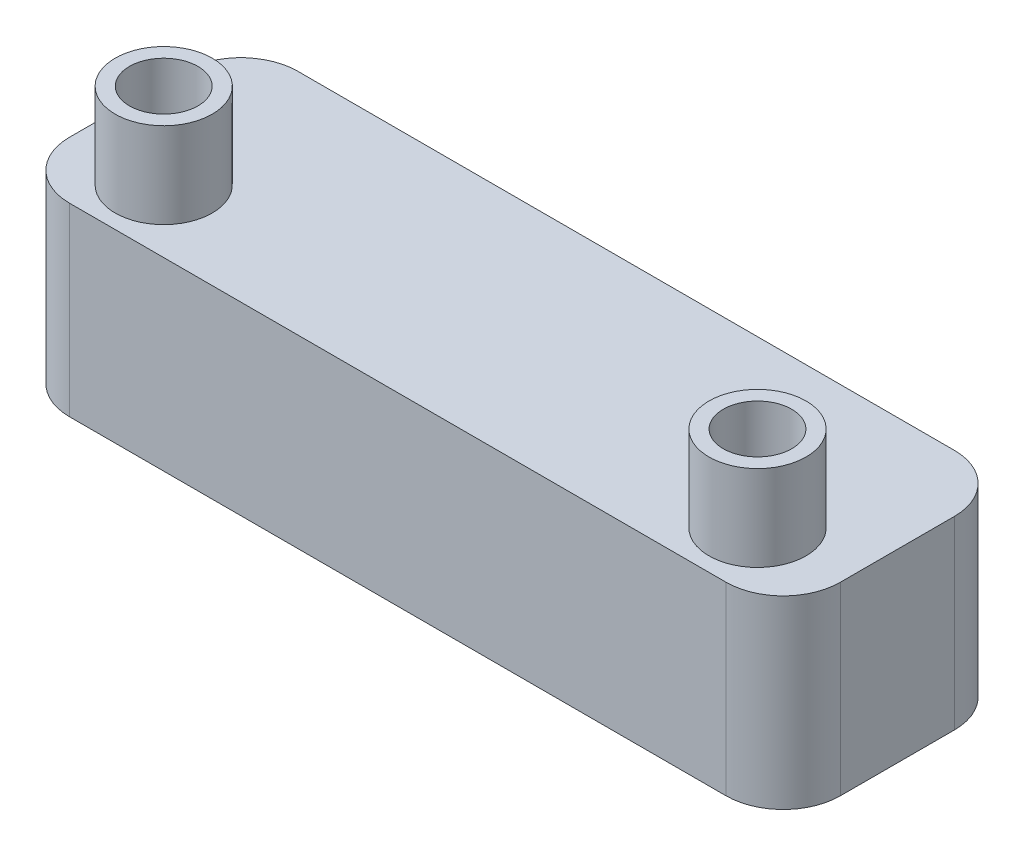
ISO-10303-21;
HEADER;
FILE_DESCRIPTION(('STEP AP214'),'2;1');
FILE_NAME('part.step','',(''),(''),'','','');
FILE_SCHEMA(('AUTOMOTIVE_DESIGN { 1 0 10303 214 1 1 1 1 }'));
ENDSEC;
DATA;
#1=APPLICATION_CONTEXT('core data for automotive mechanical design processes');
#2=APPLICATION_PROTOCOL_DEFINITION('international standard','automotive_design',2000,#1);
#3=PRODUCT_CONTEXT('',#1,'mechanical');
#4=PRODUCT('Part','Part','',(#3));
#5=PRODUCT_RELATED_PRODUCT_CATEGORY('part','',(#4));
#6=PRODUCT_DEFINITION_FORMATION('','',#4);
#7=PRODUCT_DEFINITION_CONTEXT('part definition',#1,'design');
#8=PRODUCT_DEFINITION('design','',#6,#7);
#9=PRODUCT_DEFINITION_SHAPE('','',#8);
#10=(LENGTH_UNIT() NAMED_UNIT(*) SI_UNIT(.MILLI.,.METRE.));
#11=(NAMED_UNIT(*) PLANE_ANGLE_UNIT() SI_UNIT($,.RADIAN.));
#12=(NAMED_UNIT(*) SI_UNIT($,.STERADIAN.) SOLID_ANGLE_UNIT());
#13=UNCERTAINTY_MEASURE_WITH_UNIT(LENGTH_MEASURE(1.E-05),#10,'distance_accuracy_value','');
#14=(GEOMETRIC_REPRESENTATION_CONTEXT(3) GLOBAL_UNCERTAINTY_ASSIGNED_CONTEXT((#13)) GLOBAL_UNIT_ASSIGNED_CONTEXT((#10,
#11,#12)) REPRESENTATION_CONTEXT('',''));
#15=CARTESIAN_POINT('',(0.,0.,0.));
#16=DIRECTION('',(0.,0.,1.));
#17=DIRECTION('',(1.,0.,0.));
#18=AXIS2_PLACEMENT_3D('',#15,#16,#17);
#19=CARTESIAN_POINT('',(-58.072,32.4,2.928));
#20=DIRECTION('',(0.,1.,0.));
#21=DIRECTION('',(0.,0.,1.));
#22=AXIS2_PLACEMENT_3D('',#19,#20,#21);
#23=PLANE('',#22);
#24=CARTESIAN_POINT('',(-52.,32.4,9.));
#25=DIRECTION('',(0.,1.,0.));
#26=DIRECTION('',(0.,0.,1.));
#27=AXIS2_PLACEMENT_3D('',#24,#25,#26);
#28=CIRCLE('',#27,6.);
#29=CARTESIAN_POINT('',(-52.,32.4,15.));
#30=VERTEX_POINT('',#29);
#31=EDGE_CURVE('E21',#30,#30,#28,.F.);
#32=ORIENTED_EDGE('',*,*,#31,.F.);
#33=EDGE_LOOP('',(#32));
#34=FACE_BOUND('',#33,.T.);
#35=ADVANCED_FACE('F17',(#34),#23,.T.);
#36=CARTESIAN_POINT('',(45.928,32.4,2.928));
#37=DIRECTION('',(0.,1.,0.));
#38=DIRECTION('',(0.,0.,1.));
#39=AXIS2_PLACEMENT_3D('',#36,#37,#38);
#40=PLANE('',#39);
#41=CARTESIAN_POINT('',(52.,32.4,9.));
#42=DIRECTION('',(0.,1.,0.));
#43=DIRECTION('',(0.,0.,1.));
#44=AXIS2_PLACEMENT_3D('',#41,#42,#43);
#45=CIRCLE('',#44,6.);
#46=CARTESIAN_POINT('',(52.,32.4,15.));
#47=VERTEX_POINT('',#46);
#48=EDGE_CURVE('E134',#47,#47,#45,.F.);
#49=ORIENTED_EDGE('',*,*,#48,.F.);
#50=EDGE_LOOP('',(#49));
#51=FACE_BOUND('',#50,.T.);
#52=ADVANCED_FACE('F145',(#51),#40,.T.);
#53=CARTESIAN_POINT('',(-52.,32.4,9.));
#54=DIRECTION('',(0.,1.,0.));
#55=DIRECTION('',(0.,0.,1.));
#56=AXIS2_PLACEMENT_3D('',#53,#54,#55);
#57=CYLINDRICAL_SURFACE('',#56,6.);
#58=ORIENTED_EDGE('',*,*,#31,.T.);
#59=EDGE_LOOP('',(#58));
#60=FACE_BOUND('',#59,.T.);
#61=CARTESIAN_POINT('',(-52.,47.4,9.));
#62=DIRECTION('',(0.,1.,0.));
#63=DIRECTION('',(0.,0.,1.));
#64=AXIS2_PLACEMENT_3D('',#61,#62,#63);
#65=CIRCLE('',#64,6.);
#66=CARTESIAN_POINT('',(-52.,47.4,15.));
#67=VERTEX_POINT('',#66);
#68=EDGE_CURVE('E132',#67,#67,#65,.F.);
#69=ORIENTED_EDGE('',*,*,#68,.F.);
#70=EDGE_LOOP('',(#69));
#71=FACE_BOUND('',#70,.T.);
#72=ADVANCED_FACE('F141',(#60,#71),#57,.F.);
#73=CARTESIAN_POINT('',(52.,32.4,9.));
#74=DIRECTION('',(0.,1.,0.));
#75=DIRECTION('',(0.,0.,1.));
#76=AXIS2_PLACEMENT_3D('',#73,#74,#75);
#77=CYLINDRICAL_SURFACE('',#76,6.);
#78=CARTESIAN_POINT('',(52.,47.4,9.));
#79=DIRECTION('',(0.,1.,0.));
#80=DIRECTION('',(0.,0.,1.));
#81=AXIS2_PLACEMENT_3D('',#78,#79,#80);
#82=CIRCLE('',#81,6.);
#83=CARTESIAN_POINT('',(52.,47.4,15.));
#84=VERTEX_POINT('',#83);
#85=EDGE_CURVE('E129',#84,#84,#82,.F.);
#86=ORIENTED_EDGE('',*,*,#85,.F.);
#87=EDGE_LOOP('',(#86));
#88=FACE_BOUND('',#87,.T.);
#89=ORIENTED_EDGE('',*,*,#48,.T.);
#90=EDGE_LOOP('',(#89));
#91=FACE_BOUND('',#90,.T.);
#92=ADVANCED_FACE('F204',(#88,#91),#77,.F.);
#93=CARTESIAN_POINT('',(-60.602,47.4,0.398));
#94=DIRECTION('',(0.,1.,0.));
#95=DIRECTION('',(0.,0.,1.));
#96=AXIS2_PLACEMENT_3D('',#93,#94,#95);
#97=PLANE('',#96);
#98=ORIENTED_EDGE('',*,*,#68,.T.);
#99=EDGE_LOOP('',(#98));
#100=FACE_BOUND('',#99,.T.);
#101=CARTESIAN_POINT('',(-52.,47.4,9.));
#102=DIRECTION('',(0.,-1.,0.));
#103=DIRECTION('',(0.,0.,-1.));
#104=AXIS2_PLACEMENT_3D('',#101,#102,#103);
#105=CIRCLE('',#104,8.5);
#106=CARTESIAN_POINT('',(-52.,47.4,0.5));
#107=VERTEX_POINT('',#106);
#108=EDGE_CURVE('E126',#107,#107,#105,.F.);
#109=ORIENTED_EDGE('',*,*,#108,.T.);
#110=EDGE_LOOP('',(#109));
#111=FACE_BOUND('',#110,.T.);
#112=ADVANCED_FACE('F206',(#100,#111),#97,.T.);
#113=CARTESIAN_POINT('',(43.398,47.4,0.398));
#114=DIRECTION('',(0.,1.,0.));
#115=DIRECTION('',(0.,0.,1.));
#116=AXIS2_PLACEMENT_3D('',#113,#114,#115);
#117=PLANE('',#116);
#118=ORIENTED_EDGE('',*,*,#85,.T.);
#119=EDGE_LOOP('',(#118));
#120=FACE_BOUND('',#119,.T.);
#121=CARTESIAN_POINT('',(52.,47.4,9.));
#122=DIRECTION('',(0.,-1.,0.));
#123=DIRECTION('',(0.,0.,-1.));
#124=AXIS2_PLACEMENT_3D('',#121,#122,#123);
#125=CIRCLE('',#124,8.5);
#126=CARTESIAN_POINT('',(52.,47.4,0.5));
#127=VERTEX_POINT('',#126);
#128=EDGE_CURVE('E123',#127,#127,#125,.F.);
#129=ORIENTED_EDGE('',*,*,#128,.T.);
#130=EDGE_LOOP('',(#129));
#131=FACE_BOUND('',#130,.T.);
#132=ADVANCED_FACE('F225',(#120,#131),#117,.T.);
#133=CARTESIAN_POINT('',(48.711,0.,-5.711));
#134=DIRECTION('',(0.,-1.,0.));
#135=DIRECTION('',(0.,0.,-1.));
#136=AXIS2_PLACEMENT_3D('',#133,#134,#135);
#137=PLANE('',#136);
#138=CARTESIAN_POINT('',(52.,0.,-9.));
#139=DIRECTION('',(0.,-1.,0.));
#140=DIRECTION('',(0.,0.,-1.));
#141=AXIS2_PLACEMENT_3D('',#138,#139,#140);
#142=CIRCLE('',#141,3.25);
#143=CARTESIAN_POINT('',(52.,0.,-12.25));
#144=VERTEX_POINT('',#143);
#145=EDGE_CURVE('E120',#144,#144,#142,.F.);
#146=ORIENTED_EDGE('',*,*,#145,.F.);
#147=EDGE_LOOP('',(#146));
#148=FACE_BOUND('',#147,.T.);
#149=ADVANCED_FACE('F202',(#148),#137,.T.);
#150=CARTESIAN_POINT('',(-52.,47.4,9.));
#151=DIRECTION('',(0.,-1.,0.));
#152=DIRECTION('',(0.,0.,-1.));
#153=AXIS2_PLACEMENT_3D('',#150,#151,#152);
#154=CYLINDRICAL_SURFACE('',#153,8.5);
#155=CARTESIAN_POINT('',(-52.,32.4,9.));
#156=DIRECTION('',(0.,-1.,0.));
#157=DIRECTION('',(0.,0.,-1.));
#158=AXIS2_PLACEMENT_3D('',#155,#156,#157);
#159=CIRCLE('',#158,8.5);
#160=CARTESIAN_POINT('',(-52.,32.4,0.5));
#161=VERTEX_POINT('',#160);
#162=EDGE_CURVE('E117',#161,#161,#159,.F.);
#163=ORIENTED_EDGE('',*,*,#162,.T.);
#164=EDGE_LOOP('',(#163));
#165=FACE_BOUND('',#164,.T.);
#166=ORIENTED_EDGE('',*,*,#108,.F.);
#167=EDGE_LOOP('',(#166));
#168=FACE_BOUND('',#167,.T.);
#169=ADVANCED_FACE('F198',(#165,#168),#154,.T.);
#170=CARTESIAN_POINT('',(52.,47.4,9.));
#171=DIRECTION('',(0.,-1.,0.));
#172=DIRECTION('',(0.,0.,-1.));
#173=AXIS2_PLACEMENT_3D('',#170,#171,#172);
#174=CYLINDRICAL_SURFACE('',#173,8.5);
#175=ORIENTED_EDGE('',*,*,#128,.F.);
#176=EDGE_LOOP('',(#175));
#177=FACE_BOUND('',#176,.T.);
#178=CARTESIAN_POINT('',(52.,32.4,9.));
#179=DIRECTION('',(0.,-1.,0.));
#180=DIRECTION('',(0.,0.,-1.));
#181=AXIS2_PLACEMENT_3D('',#178,#179,#180);
#182=CIRCLE('',#181,8.5);
#183=CARTESIAN_POINT('',(52.,32.4,0.5));
#184=VERTEX_POINT('',#183);
#185=EDGE_CURVE('E114',#184,#184,#182,.F.);
#186=ORIENTED_EDGE('',*,*,#185,.T.);
#187=EDGE_LOOP('',(#186));
#188=FACE_BOUND('',#187,.T.);
#189=ADVANCED_FACE('F194',(#177,#188),#174,.T.);
#190=CARTESIAN_POINT('',(52.,0.,-9.));
#191=DIRECTION('',(0.,-1.,0.));
#192=DIRECTION('',(0.,0.,-1.));
#193=AXIS2_PLACEMENT_3D('',#190,#191,#192);
#194=CYLINDRICAL_SURFACE('',#193,3.25);
#195=CARTESIAN_POINT('',(52.,-9.,-9.));
#196=DIRECTION('',(0.,-1.,0.));
#197=DIRECTION('',(0.,0.,-1.));
#198=AXIS2_PLACEMENT_3D('',#195,#196,#197);
#199=CIRCLE('',#198,3.25);
#200=CARTESIAN_POINT('',(52.,-9.,-12.25));
#201=VERTEX_POINT('',#200);
#202=EDGE_CURVE('E96',#201,#201,#199,.F.);
#203=ORIENTED_EDGE('',*,*,#202,.F.);
#204=EDGE_LOOP('',(#203));
#205=FACE_BOUND('',#204,.T.);
#206=ORIENTED_EDGE('',*,*,#145,.T.);
#207=EDGE_LOOP('',(#206));
#208=FACE_BOUND('',#207,.T.);
#209=ADVANCED_FACE('F191',(#205,#208),#194,.F.);
#210=CARTESIAN_POINT('',(-67.5,32.4,20.));
#211=DIRECTION('',(0.,-1.,0.));
#212=DIRECTION('',(0.,0.,-1.));
#213=AXIS2_PLACEMENT_3D('',#210,#211,#212);
#214=PLANE('',#213);
#215=ORIENTED_EDGE('',*,*,#185,.F.);
#216=EDGE_LOOP('',(#215));
#217=FACE_BOUND('',#216,.T.);
#218=ORIENTED_EDGE('',*,*,#162,.F.);
#219=EDGE_LOOP('',(#218));
#220=FACE_BOUND('',#219,.T.);
#221=CARTESIAN_POINT('',(-57.5,32.4,-10.));
#222=DIRECTION('',(0.,-1.,0.));
#223=DIRECTION('',(0.,0.,-1.));
#224=AXIS2_PLACEMENT_3D('',#221,#222,#223);
#225=CIRCLE('',#224,10.);
#226=CARTESIAN_POINT('',(-57.5,32.4,-20.));
#227=VERTEX_POINT('',#226);
#228=CARTESIAN_POINT('',(-67.5,32.4,-9.99999999807655));
#229=VERTEX_POINT('',#228);
#230=EDGE_CURVE('E81',#227,#229,#225,.F.);
#231=ORIENTED_EDGE('',*,*,#230,.T.);
#232=DIRECTION('',(0.,0.,1.));
#233=VECTOR('',#232,1.);
#234=CARTESIAN_POINT('',(-67.5,32.4,0.));
#235=LINE('',#234,#233);
#236=CARTESIAN_POINT('',(-67.5,32.4,10.0000000019234));
#237=VERTEX_POINT('',#236);
#238=EDGE_CURVE('E87',#229,#237,#235,.T.);
#239=ORIENTED_EDGE('',*,*,#238,.T.);
#240=CARTESIAN_POINT('',(-57.5,32.4,10.));
#241=DIRECTION('',(0.,-1.,0.));
#242=DIRECTION('',(0.,0.,-1.));
#243=AXIS2_PLACEMENT_3D('',#240,#241,#242);
#244=CIRCLE('',#243,10.);
#245=CARTESIAN_POINT('',(-57.500000002051,32.4,20.));
#246=VERTEX_POINT('',#245);
#247=EDGE_CURVE('E427',#237,#246,#244,.F.);
#248=ORIENTED_EDGE('',*,*,#247,.T.);
#249=DIRECTION('',(1.,0.,0.));
#250=VECTOR('',#249,1.);
#251=CARTESIAN_POINT('',(0.,32.4,20.));
#252=LINE('',#251,#250);
#253=CARTESIAN_POINT('',(57.5,32.4,20.));
#254=VERTEX_POINT('',#253);
#255=EDGE_CURVE('E430',#246,#254,#252,.T.);
#256=ORIENTED_EDGE('',*,*,#255,.T.);
#257=CARTESIAN_POINT('',(57.5,32.4,10.));
#258=DIRECTION('',(0.,-1.,0.));
#259=DIRECTION('',(0.,0.,-1.));
#260=AXIS2_PLACEMENT_3D('',#257,#258,#259);
#261=CIRCLE('',#260,10.);
#262=CARTESIAN_POINT('',(67.5,32.4,10.0000000010255));
#263=VERTEX_POINT('',#262);
#264=EDGE_CURVE('E428',#254,#263,#261,.F.);
#265=ORIENTED_EDGE('',*,*,#264,.T.);
#266=DIRECTION('',(0.,0.,-1.));
#267=VECTOR('',#266,1.);
#268=CARTESIAN_POINT('',(67.5,32.4,0.));
#269=LINE('',#268,#267);
#270=CARTESIAN_POINT('',(67.5,32.4,-10.));
#271=VERTEX_POINT('',#270);
#272=EDGE_CURVE('E443',#263,#271,#269,.T.);
#273=ORIENTED_EDGE('',*,*,#272,.T.);
#274=CARTESIAN_POINT('',(57.5,32.4,-10.));
#275=DIRECTION('',(0.,-1.,0.));
#276=DIRECTION('',(0.,0.,-1.));
#277=AXIS2_PLACEMENT_3D('',#274,#275,#276);
#278=CIRCLE('',#277,10.);
#279=CARTESIAN_POINT('',(57.5,32.4,-20.));
#280=VERTEX_POINT('',#279);
#281=EDGE_CURVE('E110',#271,#280,#278,.F.);
#282=ORIENTED_EDGE('',*,*,#281,.T.);
#283=DIRECTION('',(-1.,0.,0.));
#284=VECTOR('',#283,1.);
#285=CARTESIAN_POINT('',(0.,32.4,-20.));
#286=LINE('',#285,#284);
#287=EDGE_CURVE('E104',#280,#227,#286,.T.);
#288=ORIENTED_EDGE('',*,*,#287,.T.);
#289=EDGE_LOOP('',(#231,#239,#248,#256,#265,#273,#282,#288));
#290=FACE_BOUND('',#289,.T.);
#291=ADVANCED_FACE('F102',(#217,#220,#290),#214,.F.);
#292=CARTESIAN_POINT('',(45.928,-9.,-2.928));
#293=DIRECTION('',(0.,-1.,0.));
#294=DIRECTION('',(0.,0.,-1.));
#295=AXIS2_PLACEMENT_3D('',#292,#293,#294);
#296=PLANE('',#295);
#297=ORIENTED_EDGE('',*,*,#202,.T.);
#298=EDGE_LOOP('',(#297));
#299=FACE_BOUND('',#298,.T.);
#300=CARTESIAN_POINT('',(52.,-9.,-9.));
#301=DIRECTION('',(0.,1.,0.));
#302=DIRECTION('',(0.,0.,1.));
#303=AXIS2_PLACEMENT_3D('',#300,#301,#302);
#304=CIRCLE('',#303,6.);
#305=CARTESIAN_POINT('',(52.,-9.,-3.));
#306=VERTEX_POINT('',#305);
#307=EDGE_CURVE('E424',#306,#306,#304,.F.);
#308=ORIENTED_EDGE('',*,*,#307,.T.);
#309=EDGE_LOOP('',(#308));
#310=FACE_BOUND('',#309,.T.);
#311=ADVANCED_FACE('F259',(#299,#310),#296,.T.);
#312=CARTESIAN_POINT('',(-67.5,0.,10.));
#313=DIRECTION('',(1.,0.,0.));
#314=DIRECTION('',(0.,0.,-1.));
#315=AXIS2_PLACEMENT_3D('',#312,#313,#314);
#316=PLANE('',#315);
#317=DIRECTION('',(0.,1.,0.));
#318=VECTOR('',#317,1.);
#319=CARTESIAN_POINT('',(-67.5,16.2,-9.9999999961531));
#320=LINE('',#319,#318);
#321=CARTESIAN_POINT('',(-67.5,0.,-9.99999999807655));
#322=VERTEX_POINT('',#321);
#323=EDGE_CURVE('E90',#229,#322,#320,.F.);
#324=ORIENTED_EDGE('',*,*,#323,.T.);
#325=DIRECTION('',(0.,0.,-1.));
#326=VECTOR('',#325,1.);
#327=CARTESIAN_POINT('',(-67.5,0.,0.));
#328=LINE('',#327,#326);
#329=CARTESIAN_POINT('',(-67.5,0.,10.0000000019234));
#330=VERTEX_POINT('',#329);
#331=EDGE_CURVE('E423',#330,#322,#328,.T.);
#332=ORIENTED_EDGE('',*,*,#331,.F.);
#333=DIRECTION('',(0.,-1.,0.));
#334=VECTOR('',#333,1.);
#335=CARTESIAN_POINT('',(-67.5,16.2,10.0000000038469));
#336=LINE('',#335,#334);
#337=EDGE_CURVE('E92',#330,#237,#336,.F.);
#338=ORIENTED_EDGE('',*,*,#337,.T.);
#339=ORIENTED_EDGE('',*,*,#238,.F.);
#340=EDGE_LOOP('',(#324,#332,#338,#339));
#341=FACE_BOUND('',#340,.T.);
#342=ADVANCED_FACE('F88',(#341),#316,.F.);
#343=CARTESIAN_POINT('',(-57.5,32.4,-10.));
#344=DIRECTION('',(0.,-1.,0.));
#345=DIRECTION('',(0.,0.,-1.));
#346=AXIS2_PLACEMENT_3D('',#343,#344,#345);
#347=CYLINDRICAL_SURFACE('',#346,10.);
#348=DIRECTION('',(0.,-1.,0.));
#349=VECTOR('',#348,1.);
#350=CARTESIAN_POINT('',(-57.5,16.2,-20.));
#351=LINE('',#350,#349);
#352=CARTESIAN_POINT('',(-57.5,0.,-20.));
#353=VERTEX_POINT('',#352);
#354=EDGE_CURVE('E106',#227,#353,#351,.T.);
#355=ORIENTED_EDGE('',*,*,#354,.T.);
#356=CARTESIAN_POINT('',(-57.5,0.,-10.));
#357=DIRECTION('',(0.,-1.,0.));
#358=DIRECTION('',(0.,0.,-1.));
#359=AXIS2_PLACEMENT_3D('',#356,#357,#358);
#360=CIRCLE('',#359,10.);
#361=EDGE_CURVE('E99',#322,#353,#360,.T.);
#362=ORIENTED_EDGE('',*,*,#361,.F.);
#363=ORIENTED_EDGE('',*,*,#323,.F.);
#364=ORIENTED_EDGE('',*,*,#230,.F.);
#365=EDGE_LOOP('',(#355,#362,#363,#364));
#366=FACE_BOUND('',#365,.T.);
#367=ADVANCED_FACE('F98',(#366),#347,.T.);
#368=CARTESIAN_POINT('',(-57.5,0.,-20.));
#369=DIRECTION('',(0.,0.,1.));
#370=DIRECTION('',(1.,0.,0.));
#371=AXIS2_PLACEMENT_3D('',#368,#369,#370);
#372=PLANE('',#371);
#373=ORIENTED_EDGE('',*,*,#354,.F.);
#374=ORIENTED_EDGE('',*,*,#287,.F.);
#375=DIRECTION('',(0.,1.,0.));
#376=VECTOR('',#375,1.);
#377=CARTESIAN_POINT('',(57.5,16.2,-20.));
#378=LINE('',#377,#376);
#379=CARTESIAN_POINT('',(57.5,0.,-20.));
#380=VERTEX_POINT('',#379);
#381=EDGE_CURVE('E448',#280,#380,#378,.F.);
#382=ORIENTED_EDGE('',*,*,#381,.T.);
#383=DIRECTION('',(1.,0.,0.));
#384=VECTOR('',#383,1.);
#385=CARTESIAN_POINT('',(0.,0.,-20.));
#386=LINE('',#385,#384);
#387=EDGE_CURVE('E421',#353,#380,#386,.T.);
#388=ORIENTED_EDGE('',*,*,#387,.F.);
#389=EDGE_LOOP('',(#373,#374,#382,#388));
#390=FACE_BOUND('',#389,.T.);
#391=ADVANCED_FACE('F187',(#390),#372,.F.);
#392=CARTESIAN_POINT('',(57.5,32.4,-10.));
#393=DIRECTION('',(0.,-1.,0.));
#394=DIRECTION('',(0.,0.,-1.));
#395=AXIS2_PLACEMENT_3D('',#392,#393,#394);
#396=CYLINDRICAL_SURFACE('',#395,10.);
#397=DIRECTION('',(0.,-1.,0.));
#398=VECTOR('',#397,1.);
#399=CARTESIAN_POINT('',(67.5,16.2,-10.));
#400=LINE('',#399,#398);
#401=CARTESIAN_POINT('',(67.5,0.,-10.));
#402=VERTEX_POINT('',#401);
#403=EDGE_CURVE('E437',#271,#402,#400,.T.);
#404=ORIENTED_EDGE('',*,*,#403,.T.);
#405=CARTESIAN_POINT('',(57.5,0.,-10.));
#406=DIRECTION('',(0.,-1.,0.));
#407=DIRECTION('',(0.,0.,-1.));
#408=AXIS2_PLACEMENT_3D('',#405,#406,#407);
#409=CIRCLE('',#408,10.);
#410=EDGE_CURVE('E419',#380,#402,#409,.T.);
#411=ORIENTED_EDGE('',*,*,#410,.F.);
#412=ORIENTED_EDGE('',*,*,#381,.F.);
#413=ORIENTED_EDGE('',*,*,#281,.F.);
#414=EDGE_LOOP('',(#404,#411,#412,#413));
#415=FACE_BOUND('',#414,.T.);
#416=ADVANCED_FACE('F184',(#415),#396,.T.);
#417=CARTESIAN_POINT('',(67.5,0.,-10.));
#418=DIRECTION('',(-1.,0.,0.));
#419=DIRECTION('',(0.,0.,1.));
#420=AXIS2_PLACEMENT_3D('',#417,#418,#419);
#421=PLANE('',#420);
#422=ORIENTED_EDGE('',*,*,#403,.F.);
#423=ORIENTED_EDGE('',*,*,#272,.F.);
#424=DIRECTION('',(0.,1.,0.));
#425=VECTOR('',#424,1.);
#426=CARTESIAN_POINT('',(67.5,16.2,10.000000002051));
#427=LINE('',#426,#425);
#428=CARTESIAN_POINT('',(67.5,0.,10.0000000010255));
#429=VERTEX_POINT('',#428);
#430=EDGE_CURVE('E431',#263,#429,#427,.F.);
#431=ORIENTED_EDGE('',*,*,#430,.T.);
#432=DIRECTION('',(0.,0.,1.));
#433=VECTOR('',#432,1.);
#434=CARTESIAN_POINT('',(67.5,0.,0.));
#435=LINE('',#434,#433);
#436=EDGE_CURVE('E418',#402,#429,#435,.T.);
#437=ORIENTED_EDGE('',*,*,#436,.F.);
#438=EDGE_LOOP('',(#422,#423,#431,#437));
#439=FACE_BOUND('',#438,.T.);
#440=ADVANCED_FACE('F182',(#439),#421,.F.);
#441=CARTESIAN_POINT('',(57.5,32.4,10.));
#442=DIRECTION('',(0.,-1.,0.));
#443=DIRECTION('',(0.,0.,-1.));
#444=AXIS2_PLACEMENT_3D('',#441,#442,#443);
#445=CYLINDRICAL_SURFACE('',#444,10.);
#446=DIRECTION('',(0.,-1.,0.));
#447=VECTOR('',#446,1.);
#448=CARTESIAN_POINT('',(57.5,16.2,20.));
#449=LINE('',#448,#447);
#450=CARTESIAN_POINT('',(57.5,0.,20.));
#451=VERTEX_POINT('',#450);
#452=EDGE_CURVE('E434',#254,#451,#449,.T.);
#453=ORIENTED_EDGE('',*,*,#452,.T.);
#454=CARTESIAN_POINT('',(57.5,0.,10.));
#455=DIRECTION('',(0.,-1.,0.));
#456=DIRECTION('',(0.,0.,-1.));
#457=AXIS2_PLACEMENT_3D('',#454,#455,#456);
#458=CIRCLE('',#457,10.);
#459=EDGE_CURVE('E416',#429,#451,#458,.T.);
#460=ORIENTED_EDGE('',*,*,#459,.F.);
#461=ORIENTED_EDGE('',*,*,#430,.F.);
#462=ORIENTED_EDGE('',*,*,#264,.F.);
#463=EDGE_LOOP('',(#453,#460,#461,#462));
#464=FACE_BOUND('',#463,.T.);
#465=ADVANCED_FACE('F179',(#464),#445,.T.);
#466=CARTESIAN_POINT('',(57.5,0.,20.));
#467=DIRECTION('',(0.,0.,-1.));
#468=DIRECTION('',(-1.,0.,0.));
#469=AXIS2_PLACEMENT_3D('',#466,#467,#468);
#470=PLANE('',#469);
#471=ORIENTED_EDGE('',*,*,#452,.F.);
#472=ORIENTED_EDGE('',*,*,#255,.F.);
#473=DIRECTION('',(0.,1.,0.));
#474=VECTOR('',#473,1.);
#475=CARTESIAN_POINT('',(-57.5000000041021,16.2,20.));
#476=LINE('',#475,#474);
#477=CARTESIAN_POINT('',(-57.500000002051,0.,20.));
#478=VERTEX_POINT('',#477);
#479=EDGE_CURVE('E460',#246,#478,#476,.F.);
#480=ORIENTED_EDGE('',*,*,#479,.T.);
#481=DIRECTION('',(-1.,0.,0.));
#482=VECTOR('',#481,1.);
#483=CARTESIAN_POINT('',(0.,0.,20.));
#484=LINE('',#483,#482);
#485=EDGE_CURVE('E36',#451,#478,#484,.T.);
#486=ORIENTED_EDGE('',*,*,#485,.F.);
#487=EDGE_LOOP('',(#471,#472,#480,#486));
#488=FACE_BOUND('',#487,.T.);
#489=ADVANCED_FACE('F177',(#488),#470,.F.);
#490=CARTESIAN_POINT('',(-57.5,32.4,10.));
#491=DIRECTION('',(0.,-1.,0.));
#492=DIRECTION('',(0.,0.,-1.));
#493=AXIS2_PLACEMENT_3D('',#490,#491,#492);
#494=CYLINDRICAL_SURFACE('',#493,10.);
#495=ORIENTED_EDGE('',*,*,#337,.F.);
#496=CARTESIAN_POINT('',(-57.5,0.,10.));
#497=DIRECTION('',(0.,-1.,0.));
#498=DIRECTION('',(0.,0.,-1.));
#499=AXIS2_PLACEMENT_3D('',#496,#497,#498);
#500=CIRCLE('',#499,10.);
#501=EDGE_CURVE('E414',#478,#330,#500,.T.);
#502=ORIENTED_EDGE('',*,*,#501,.F.);
#503=ORIENTED_EDGE('',*,*,#479,.F.);
#504=ORIENTED_EDGE('',*,*,#247,.F.);
#505=EDGE_LOOP('',(#495,#502,#503,#504));
#506=FACE_BOUND('',#505,.T.);
#507=ADVANCED_FACE('F173',(#506),#494,.T.);
#508=CARTESIAN_POINT('',(52.,-9.,-9.));
#509=DIRECTION('',(0.,1.,0.));
#510=DIRECTION('',(0.,0.,1.));
#511=AXIS2_PLACEMENT_3D('',#508,#509,#510);
#512=CYLINDRICAL_SURFACE('',#511,6.);
#513=CARTESIAN_POINT('',(52.,0.,-9.));
#514=DIRECTION('',(0.,1.,0.));
#515=DIRECTION('',(0.,0.,1.));
#516=AXIS2_PLACEMENT_3D('',#513,#514,#515);
#517=CIRCLE('',#516,6.);
#518=CARTESIAN_POINT('',(52.,0.,-3.));
#519=VERTEX_POINT('',#518);
#520=EDGE_CURVE('E411',#519,#519,#517,.T.);
#521=ORIENTED_EDGE('',*,*,#520,.F.);
#522=EDGE_LOOP('',(#521));
#523=FACE_BOUND('',#522,.T.);
#524=ORIENTED_EDGE('',*,*,#307,.F.);
#525=EDGE_LOOP('',(#524));
#526=FACE_BOUND('',#525,.T.);
#527=ADVANCED_FACE('F170',(#523,#526),#512,.T.);
#528=CARTESIAN_POINT('',(-67.5,0.,20.));
#529=DIRECTION('',(0.,-1.,0.));
#530=DIRECTION('',(0.,0.,-1.));
#531=AXIS2_PLACEMENT_3D('',#528,#529,#530);
#532=PLANE('',#531);
#533=ORIENTED_EDGE('',*,*,#520,.T.);
#534=EDGE_LOOP('',(#533));
#535=FACE_BOUND('',#534,.T.);
#536=CARTESIAN_POINT('',(-52.,0.,-9.));
#537=DIRECTION('',(0.,1.,0.));
#538=DIRECTION('',(0.,0.,1.));
#539=AXIS2_PLACEMENT_3D('',#536,#537,#538);
#540=CIRCLE('',#539,6.);
#541=CARTESIAN_POINT('',(-52.,0.,-3.));
#542=VERTEX_POINT('',#541);
#543=EDGE_CURVE('E406',#542,#542,#540,.T.);
#544=ORIENTED_EDGE('',*,*,#543,.T.);
#545=EDGE_LOOP('',(#544));
#546=FACE_BOUND('',#545,.T.);
#547=ORIENTED_EDGE('',*,*,#485,.T.);
#548=ORIENTED_EDGE('',*,*,#501,.T.);
#549=ORIENTED_EDGE('',*,*,#331,.T.);
#550=ORIENTED_EDGE('',*,*,#361,.T.);
#551=ORIENTED_EDGE('',*,*,#387,.T.);
#552=ORIENTED_EDGE('',*,*,#410,.T.);
#553=ORIENTED_EDGE('',*,*,#436,.T.);
#554=ORIENTED_EDGE('',*,*,#459,.T.);
#555=EDGE_LOOP('',(#547,#548,#549,#550,#551,#552,#553,#554));
#556=FACE_BOUND('',#555,.T.);
#557=ADVANCED_FACE('F168',(#535,#546,#556),#532,.T.);
#558=CARTESIAN_POINT('',(-52.,-9.,-9.));
#559=DIRECTION('',(0.,1.,0.));
#560=DIRECTION('',(0.,0.,1.));
#561=AXIS2_PLACEMENT_3D('',#558,#559,#560);
#562=CYLINDRICAL_SURFACE('',#561,6.);
#563=CARTESIAN_POINT('',(-52.,-9.,-9.));
#564=DIRECTION('',(0.,1.,0.));
#565=DIRECTION('',(0.,0.,1.));
#566=AXIS2_PLACEMENT_3D('',#563,#564,#565);
#567=CIRCLE('',#566,6.);
#568=CARTESIAN_POINT('',(-52.,-9.,-3.));
#569=VERTEX_POINT('',#568);
#570=EDGE_CURVE('E403',#569,#569,#567,.F.);
#571=ORIENTED_EDGE('',*,*,#570,.F.);
#572=EDGE_LOOP('',(#571));
#573=FACE_BOUND('',#572,.T.);
#574=ORIENTED_EDGE('',*,*,#543,.F.);
#575=EDGE_LOOP('',(#574));
#576=FACE_BOUND('',#575,.T.);
#577=ADVANCED_FACE('F165',(#573,#576),#562,.T.);
#578=CARTESIAN_POINT('',(-55.289,0.,-5.711));
#579=DIRECTION('',(0.,-1.,0.));
#580=DIRECTION('',(0.,0.,-1.));
#581=AXIS2_PLACEMENT_3D('',#578,#579,#580);
#582=PLANE('',#581);
#583=CARTESIAN_POINT('',(-52.,0.,-9.));
#584=DIRECTION('',(0.,-1.,0.));
#585=DIRECTION('',(0.,0.,-1.));
#586=AXIS2_PLACEMENT_3D('',#583,#584,#585);
#587=CIRCLE('',#586,3.25);
#588=CARTESIAN_POINT('',(-52.,0.,-12.25));
#589=VERTEX_POINT('',#588);
#590=EDGE_CURVE('E27',#589,#589,#587,.F.);
#591=ORIENTED_EDGE('',*,*,#590,.F.);
#592=EDGE_LOOP('',(#591));
#593=FACE_BOUND('',#592,.T.);
#594=ADVANCED_FACE('F161',(#593),#582,.T.);
#595=CARTESIAN_POINT('',(-58.072,-9.,-2.928));
#596=DIRECTION('',(0.,-1.,0.));
#597=DIRECTION('',(0.,0.,-1.));
#598=AXIS2_PLACEMENT_3D('',#595,#596,#597);
#599=PLANE('',#598);
#600=CARTESIAN_POINT('',(-52.,-9.,-9.));
#601=DIRECTION('',(0.,-1.,0.));
#602=DIRECTION('',(0.,0.,-1.));
#603=AXIS2_PLACEMENT_3D('',#600,#601,#602);
#604=CIRCLE('',#603,3.25);
#605=CARTESIAN_POINT('',(-52.,-9.,-12.25));
#606=VERTEX_POINT('',#605);
#607=EDGE_CURVE('E11',#606,#606,#604,.T.);
#608=ORIENTED_EDGE('',*,*,#607,.F.);
#609=EDGE_LOOP('',(#608));
#610=FACE_BOUND('',#609,.T.);
#611=ORIENTED_EDGE('',*,*,#570,.T.);
#612=EDGE_LOOP('',(#611));
#613=FACE_BOUND('',#612,.T.);
#614=ADVANCED_FACE('F19',(#610,#613),#599,.T.);
#615=CARTESIAN_POINT('',(-52.,0.,-9.));
#616=DIRECTION('',(0.,-1.,0.));
#617=DIRECTION('',(0.,0.,-1.));
#618=AXIS2_PLACEMENT_3D('',#615,#616,#617);
#619=CYLINDRICAL_SURFACE('',#618,3.25);
#620=ORIENTED_EDGE('',*,*,#607,.T.);
#621=EDGE_LOOP('',(#620));
#622=FACE_BOUND('',#621,.T.);
#623=ORIENTED_EDGE('',*,*,#590,.T.);
#624=EDGE_LOOP('',(#623));
#625=FACE_BOUND('',#624,.T.);
#626=ADVANCED_FACE('F154',(#622,#625),#619,.F.);
#627=CLOSED_SHELL('',(#35,#52,#72,#92,#112,#132,#149,#169,#189,#209,#291,#311,#342,#367,#391,
#416,#440,#465,#489,#507,#527,#557,#577,#594,#614,#626));
#628=MANIFOLD_SOLID_BREP('B1',#627);
#629=ADVANCED_BREP_SHAPE_REPRESENTATION('',(#18,#628),#14);
#630=SHAPE_DEFINITION_REPRESENTATION(#9,#629);
ENDSEC;
END-ISO-10303-21;
